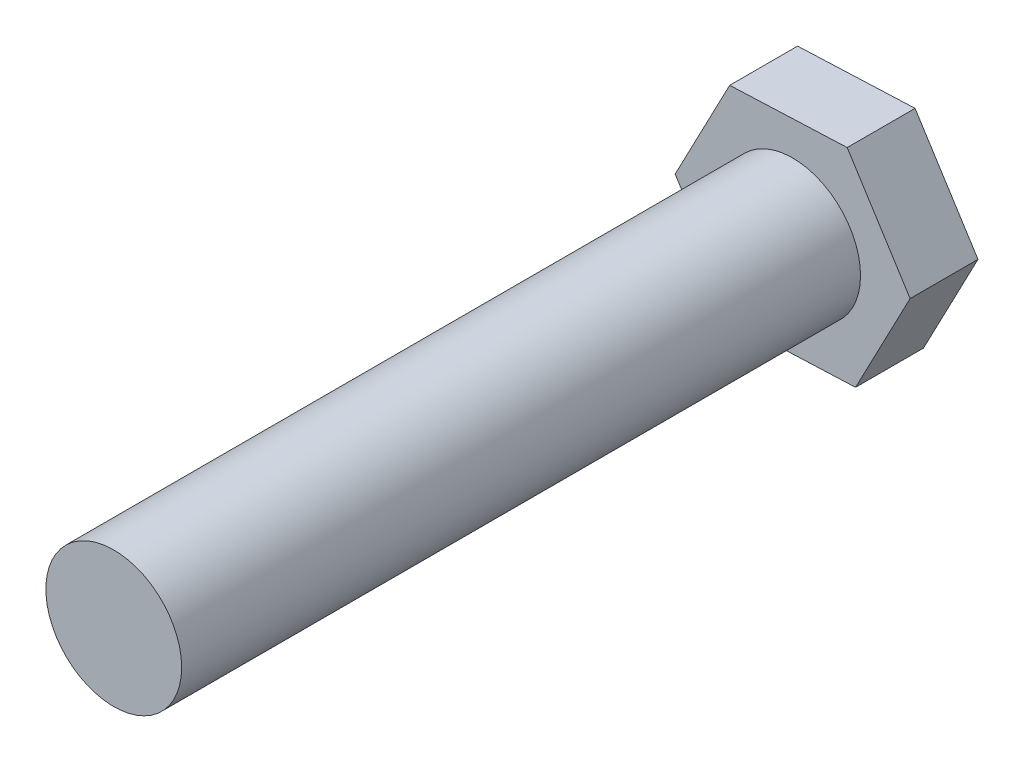
ISO-10303-21;
HEADER;
FILE_DESCRIPTION(('STEP AP214'),'2;1');
FILE_NAME('part.step','',(''),(''),'','','');
FILE_SCHEMA(('AUTOMOTIVE_DESIGN { 1 0 10303 214 1 1 1 1 }'));
ENDSEC;
DATA;
#1=APPLICATION_CONTEXT('core data for automotive mechanical design processes');
#2=APPLICATION_PROTOCOL_DEFINITION('international standard','automotive_design',2000,#1);
#3=PRODUCT_CONTEXT('',#1,'mechanical');
#4=PRODUCT('Part','Part','',(#3));
#5=PRODUCT_RELATED_PRODUCT_CATEGORY('part','',(#4));
#6=PRODUCT_DEFINITION_FORMATION('','',#4);
#7=PRODUCT_DEFINITION_CONTEXT('part definition',#1,'design');
#8=PRODUCT_DEFINITION('design','',#6,#7);
#9=PRODUCT_DEFINITION_SHAPE('','',#8);
#10=(LENGTH_UNIT() NAMED_UNIT(*) SI_UNIT(.MILLI.,.METRE.));
#11=(NAMED_UNIT(*) PLANE_ANGLE_UNIT() SI_UNIT($,.RADIAN.));
#12=(NAMED_UNIT(*) SI_UNIT($,.STERADIAN.) SOLID_ANGLE_UNIT());
#13=UNCERTAINTY_MEASURE_WITH_UNIT(LENGTH_MEASURE(1.E-05),#10,'distance_accuracy_value','');
#14=(GEOMETRIC_REPRESENTATION_CONTEXT(3) GLOBAL_UNCERTAINTY_ASSIGNED_CONTEXT((#13)) GLOBAL_UNIT_ASSIGNED_CONTEXT((#10,
#11,#12)) REPRESENTATION_CONTEXT('',''));
#15=CARTESIAN_POINT('',(0.,0.,0.));
#16=DIRECTION('',(0.,0.,1.));
#17=DIRECTION('',(1.,0.,0.));
#18=AXIS2_PLACEMENT_3D('',#15,#16,#17);
#19=CARTESIAN_POINT('',(-1.60723007763086,-3.06868236830707,2.));
#20=DIRECTION('',(-0.0411186284421723,0.999154271569228,0.));
#21=DIRECTION('',(-0.999154271569228,-0.0411186284421723,0.));
#22=AXIS2_PLACEMENT_3D('',#19,#20,#21);
#23=PLANE('',#22);
#24=DIRECTION('',(0.999154271569228,0.0411186284421723,0.));
#25=VECTOR('',#24,1.);
#26=CARTESIAN_POINT('',(-1.60723007763086,-3.06868236830707,0.));
#27=LINE('',#26,#25);
#28=CARTESIAN_POINT('',(-1.60723007763086,-3.06868236830707,0.));
#29=VERTEX_POINT('',#28);
#30=CARTESIAN_POINT('',(1.85394184828389,-2.9262432611083,0.));
#31=VERTEX_POINT('',#30);
#32=EDGE_CURVE('E130',#29,#31,#27,.T.);
#33=ORIENTED_EDGE('',*,*,#32,.T.);
#34=DIRECTION('',(0.,0.,-1.));
#35=VECTOR('',#34,1.);
#36=CARTESIAN_POINT('',(1.85394184828389,-2.9262432611083,2.));
#37=LINE('',#36,#35);
#38=CARTESIAN_POINT('',(1.85394184828389,-2.9262432611083,2.));
#39=VERTEX_POINT('',#38);
#40=EDGE_CURVE('E42',#39,#31,#37,.T.);
#41=ORIENTED_EDGE('',*,*,#40,.F.);
#42=DIRECTION('',(0.999154271569228,0.0411186284421723,0.));
#43=VECTOR('',#42,1.);
#44=CARTESIAN_POINT('',(-1.60723007763086,-3.06868236830707,2.));
#45=LINE('',#44,#43);
#46=CARTESIAN_POINT('',(-1.60723007763086,-3.06868236830707,2.));
#47=VERTEX_POINT('',#46);
#48=EDGE_CURVE('E147',#47,#39,#45,.T.);
#49=ORIENTED_EDGE('',*,*,#48,.F.);
#50=DIRECTION('',(0.,0.,-1.));
#51=VECTOR('',#50,1.);
#52=CARTESIAN_POINT('',(-1.60723007763086,-3.06868236830707,2.));
#53=LINE('',#52,#51);
#54=EDGE_CURVE('E126',#47,#29,#53,.T.);
#55=ORIENTED_EDGE('',*,*,#54,.T.);
#56=EDGE_LOOP('',(#33,#41,#49,#55));
#57=FACE_BOUND('',#56,.T.);
#58=ADVANCED_FACE('F39',(#57),#23,.F.);
#59=CARTESIAN_POINT('',(1.85394184828389,-2.9262432611083,2.));
#60=DIRECTION('',(-0.885852295699773,0.46396735898492,0.));
#61=DIRECTION('',(-0.46396735898492,-0.885852295699773,0.));
#62=AXIS2_PLACEMENT_3D('',#59,#60,#61);
#63=PLANE('',#62);
#64=DIRECTION('',(0.463967358984919,0.885852295699773,0.));
#65=VECTOR('',#64,1.);
#66=CARTESIAN_POINT('',(1.85394184828389,-2.9262432611083,0.));
#67=LINE('',#66,#65);
#68=CARTESIAN_POINT('',(3.46117192591475,0.142439107198778,0.));
#69=VERTEX_POINT('',#68);
#70=EDGE_CURVE('E134',#31,#69,#67,.T.);
#71=ORIENTED_EDGE('',*,*,#70,.T.);
#72=DIRECTION('',(0.,0.,-1.));
#73=VECTOR('',#72,1.);
#74=CARTESIAN_POINT('',(3.46117192591475,0.142439107198778,2.));
#75=LINE('',#74,#73);
#76=CARTESIAN_POINT('',(3.46117192591475,0.142439107198778,2.));
#77=VERTEX_POINT('',#76);
#78=EDGE_CURVE('E153',#77,#69,#75,.T.);
#79=ORIENTED_EDGE('',*,*,#78,.F.);
#80=DIRECTION('',(0.463967358984919,0.885852295699773,0.));
#81=VECTOR('',#80,1.);
#82=CARTESIAN_POINT('',(1.85394184828389,-2.9262432611083,2.));
#83=LINE('',#82,#81);
#84=EDGE_CURVE('E95',#39,#77,#83,.T.);
#85=ORIENTED_EDGE('',*,*,#84,.F.);
#86=ORIENTED_EDGE('',*,*,#40,.T.);
#87=EDGE_LOOP('',(#71,#79,#85,#86));
#88=FACE_BOUND('',#87,.T.);
#89=ADVANCED_FACE('F160',(#88),#63,.F.);
#90=CARTESIAN_POINT('',(3.46117192591475,0.142439107198778,2.));
#91=DIRECTION('',(-0.844733667257601,-0.535186912584308,0.));
#92=DIRECTION('',(0.535186912584308,-0.844733667257601,0.));
#93=AXIS2_PLACEMENT_3D('',#90,#91,#92);
#94=PLANE('',#93);
#95=DIRECTION('',(-0.535186912584308,0.844733667257601,0.));
#96=VECTOR('',#95,1.);
#97=CARTESIAN_POINT('',(3.46117192591475,0.142439107198778,0.));
#98=LINE('',#97,#96);
#99=CARTESIAN_POINT('',(1.60723007763086,3.06868236830707,0.));
#100=VERTEX_POINT('',#99);
#101=EDGE_CURVE('E138',#69,#100,#98,.T.);
#102=ORIENTED_EDGE('',*,*,#101,.T.);
#103=DIRECTION('',(0.,0.,-1.));
#104=VECTOR('',#103,1.);
#105=CARTESIAN_POINT('',(1.60723007763086,3.06868236830707,2.));
#106=LINE('',#105,#104);
#107=CARTESIAN_POINT('',(1.60723007763086,3.06868236830707,2.));
#108=VERTEX_POINT('',#107);
#109=EDGE_CURVE('E119',#108,#100,#106,.T.);
#110=ORIENTED_EDGE('',*,*,#109,.F.);
#111=DIRECTION('',(-0.535186912584308,0.844733667257601,0.));
#112=VECTOR('',#111,1.);
#113=CARTESIAN_POINT('',(3.46117192591475,0.142439107198778,2.));
#114=LINE('',#113,#112);
#115=EDGE_CURVE('E108',#77,#108,#114,.T.);
#116=ORIENTED_EDGE('',*,*,#115,.F.);
#117=ORIENTED_EDGE('',*,*,#78,.T.);
#118=EDGE_LOOP('',(#102,#110,#116,#117));
#119=FACE_BOUND('',#118,.T.);
#120=ADVANCED_FACE('F166',(#119),#94,.F.);
#121=CARTESIAN_POINT('',(1.60723007763086,3.06868236830707,2.));
#122=DIRECTION('',(0.0411186284421721,-0.999154271569228,0.));
#123=DIRECTION('',(0.999154271569228,0.0411186284421721,0.));
#124=AXIS2_PLACEMENT_3D('',#121,#122,#123);
#125=PLANE('',#124);
#126=DIRECTION('',(-0.999154271569228,-0.0411186284421721,0.));
#127=VECTOR('',#126,1.);
#128=CARTESIAN_POINT('',(1.60723007763086,3.06868236830707,0.));
#129=LINE('',#128,#127);
#130=CARTESIAN_POINT('',(-1.85394184828389,2.9262432611083,0.));
#131=VERTEX_POINT('',#130);
#132=EDGE_CURVE('E117',#100,#131,#129,.T.);
#133=ORIENTED_EDGE('',*,*,#132,.T.);
#134=DIRECTION('',(0.,0.,-1.));
#135=VECTOR('',#134,1.);
#136=CARTESIAN_POINT('',(-1.85394184828389,2.9262432611083,2.));
#137=LINE('',#136,#135);
#138=CARTESIAN_POINT('',(-1.85394184828389,2.9262432611083,2.));
#139=VERTEX_POINT('',#138);
#140=EDGE_CURVE('E114',#139,#131,#137,.T.);
#141=ORIENTED_EDGE('',*,*,#140,.F.);
#142=DIRECTION('',(-0.999154271569228,-0.0411186284421721,0.));
#143=VECTOR('',#142,1.);
#144=CARTESIAN_POINT('',(1.60723007763086,3.06868236830707,2.));
#145=LINE('',#144,#143);
#146=EDGE_CURVE('E102',#108,#139,#145,.T.);
#147=ORIENTED_EDGE('',*,*,#146,.F.);
#148=ORIENTED_EDGE('',*,*,#109,.T.);
#149=EDGE_LOOP('',(#133,#141,#147,#148));
#150=FACE_BOUND('',#149,.T.);
#151=ADVANCED_FACE('F115',(#150),#125,.F.);
#152=CARTESIAN_POINT('',(-1.85394184828389,2.9262432611083,2.));
#153=DIRECTION('',(0.885852295699773,-0.46396735898492,0.));
#154=DIRECTION('',(0.46396735898492,0.885852295699773,0.));
#155=AXIS2_PLACEMENT_3D('',#152,#153,#154);
#156=PLANE('',#155);
#157=DIRECTION('',(-0.46396735898492,-0.885852295699773,0.));
#158=VECTOR('',#157,1.);
#159=CARTESIAN_POINT('',(-1.85394184828389,2.9262432611083,0.));
#160=LINE('',#159,#158);
#161=CARTESIAN_POINT('',(-3.46117192591475,-0.142439107198777,0.));
#162=VERTEX_POINT('',#161);
#163=EDGE_CURVE('E80',#131,#162,#160,.T.);
#164=ORIENTED_EDGE('',*,*,#163,.T.);
#165=DIRECTION('',(0.,0.,-1.));
#166=VECTOR('',#165,1.);
#167=CARTESIAN_POINT('',(-3.46117192591475,-0.142439107198777,2.));
#168=LINE('',#167,#166);
#169=CARTESIAN_POINT('',(-3.46117192591475,-0.142439107198777,2.));
#170=VERTEX_POINT('',#169);
#171=EDGE_CURVE('E120',#170,#162,#168,.T.);
#172=ORIENTED_EDGE('',*,*,#171,.F.);
#173=DIRECTION('',(-0.46396735898492,-0.885852295699773,0.));
#174=VECTOR('',#173,1.);
#175=CARTESIAN_POINT('',(-1.85394184828389,2.9262432611083,2.));
#176=LINE('',#175,#174);
#177=EDGE_CURVE('E106',#139,#170,#176,.T.);
#178=ORIENTED_EDGE('',*,*,#177,.F.);
#179=ORIENTED_EDGE('',*,*,#140,.T.);
#180=EDGE_LOOP('',(#164,#172,#178,#179));
#181=FACE_BOUND('',#180,.T.);
#182=ADVANCED_FACE('F122',(#181),#156,.F.);
#183=CARTESIAN_POINT('',(-3.46117192591475,-0.142439107198777,2.));
#184=DIRECTION('',(0.844733667257601,0.535186912584308,0.));
#185=DIRECTION('',(-0.535186912584308,0.844733667257601,0.));
#186=AXIS2_PLACEMENT_3D('',#183,#184,#185);
#187=PLANE('',#186);
#188=DIRECTION('',(0.535186912584308,-0.844733667257601,0.));
#189=VECTOR('',#188,1.);
#190=CARTESIAN_POINT('',(-3.46117192591475,-0.142439107198777,0.));
#191=LINE('',#190,#189);
#192=EDGE_CURVE('E86',#162,#29,#191,.T.);
#193=ORIENTED_EDGE('',*,*,#192,.T.);
#194=ORIENTED_EDGE('',*,*,#54,.F.);
#195=DIRECTION('',(0.535186912584308,-0.844733667257601,0.));
#196=VECTOR('',#195,1.);
#197=CARTESIAN_POINT('',(-3.46117192591475,-0.142439107198777,2.));
#198=LINE('',#197,#196);
#199=EDGE_CURVE('E57',#170,#47,#198,.T.);
#200=ORIENTED_EDGE('',*,*,#199,.F.);
#201=ORIENTED_EDGE('',*,*,#171,.T.);
#202=EDGE_LOOP('',(#193,#194,#200,#201));
#203=FACE_BOUND('',#202,.T.);
#204=ADVANCED_FACE('F186',(#203),#187,.F.);
#205=CARTESIAN_POINT('',(0.,0.,2.));
#206=DIRECTION('',(0.,0.,1.));
#207=DIRECTION('',(1.,0.,0.));
#208=AXIS2_PLACEMENT_3D('',#205,#206,#207);
#209=PLANE('',#208);
#210=CARTESIAN_POINT('',(0.,0.,2.));
#211=DIRECTION('',(0.,0.,1.));
#212=DIRECTION('',(1.,0.,0.));
#213=AXIS2_PLACEMENT_3D('',#210,#211,#212);
#214=CIRCLE('',#213,2.);
#215=CARTESIAN_POINT('',(2.,0.,2.));
#216=VERTEX_POINT('',#215);
#217=EDGE_CURVE('E11',#216,#216,#214,.T.);
#218=ORIENTED_EDGE('',*,*,#217,.F.);
#219=EDGE_LOOP('',(#218));
#220=FACE_BOUND('',#219,.T.);
#221=ORIENTED_EDGE('',*,*,#48,.T.);
#222=ORIENTED_EDGE('',*,*,#84,.T.);
#223=ORIENTED_EDGE('',*,*,#115,.T.);
#224=ORIENTED_EDGE('',*,*,#146,.T.);
#225=ORIENTED_EDGE('',*,*,#177,.T.);
#226=ORIENTED_EDGE('',*,*,#199,.T.);
#227=EDGE_LOOP('',(#221,#222,#223,#224,#225,#226));
#228=FACE_BOUND('',#227,.T.);
#229=ADVANCED_FACE('F104',(#220,#228),#209,.T.);
#230=CARTESIAN_POINT('',(0.,0.,0.));
#231=DIRECTION('',(0.,0.,1.));
#232=DIRECTION('',(1.,0.,0.));
#233=AXIS2_PLACEMENT_3D('',#230,#231,#232);
#234=PLANE('',#233);
#235=ORIENTED_EDGE('',*,*,#32,.F.);
#236=ORIENTED_EDGE('',*,*,#192,.F.);
#237=ORIENTED_EDGE('',*,*,#163,.F.);
#238=ORIENTED_EDGE('',*,*,#132,.F.);
#239=ORIENTED_EDGE('',*,*,#101,.F.);
#240=ORIENTED_EDGE('',*,*,#70,.F.);
#241=EDGE_LOOP('',(#235,#236,#237,#238,#239,#240));
#242=FACE_BOUND('',#241,.T.);
#243=ADVANCED_FACE('F165',(#242),#234,.F.);
#244=CARTESIAN_POINT('',(0.,0.,22.));
#245=DIRECTION('',(0.,0.,-1.));
#246=DIRECTION('',(-1.,0.,0.));
#247=AXIS2_PLACEMENT_3D('',#244,#245,#246);
#248=CYLINDRICAL_SURFACE('',#247,2.);
#249=CARTESIAN_POINT('',(0.,0.,22.));
#250=DIRECTION('',(0.,0.,1.));
#251=DIRECTION('',(1.,0.,0.));
#252=AXIS2_PLACEMENT_3D('',#249,#250,#251);
#253=CIRCLE('',#252,2.);
#254=CARTESIAN_POINT('',(2.,0.,22.));
#255=VERTEX_POINT('',#254);
#256=EDGE_CURVE('E135',#255,#255,#253,.T.);
#257=ORIENTED_EDGE('',*,*,#256,.F.);
#258=EDGE_LOOP('',(#257));
#259=FACE_BOUND('',#258,.T.);
#260=ORIENTED_EDGE('',*,*,#217,.T.);
#261=EDGE_LOOP('',(#260));
#262=FACE_BOUND('',#261,.T.);
#263=ADVANCED_FACE('F179',(#259,#262),#248,.T.);
#264=CARTESIAN_POINT('',(0.,0.,22.));
#265=DIRECTION('',(0.,0.,1.));
#266=DIRECTION('',(1.,0.,0.));
#267=AXIS2_PLACEMENT_3D('',#264,#265,#266);
#268=PLANE('',#267);
#269=ORIENTED_EDGE('',*,*,#256,.T.);
#270=EDGE_LOOP('',(#269));
#271=FACE_BOUND('',#270,.T.);
#272=ADVANCED_FACE('F177',(#271),#268,.T.);
#273=CLOSED_SHELL('',(#58,#89,#120,#151,#182,#204,#229,#243,#263,#272));
#274=MANIFOLD_SOLID_BREP('B2',#273);
#275=ADVANCED_BREP_SHAPE_REPRESENTATION('',(#18,#274),#14);
#276=SHAPE_DEFINITION_REPRESENTATION(#9,#275);
ENDSEC;
END-ISO-10303-21;
